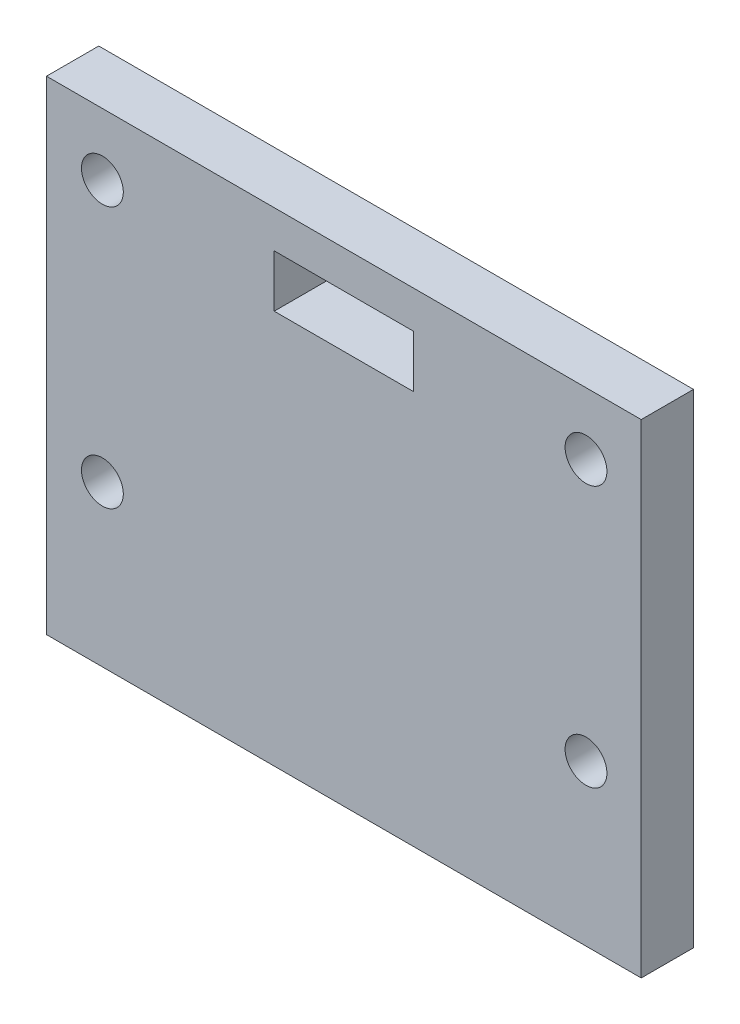
ISO-10303-21;
HEADER;
FILE_DESCRIPTION(('STEP AP214'),'2;1');
FILE_NAME('part.step','',(''),(''),'','','');
FILE_SCHEMA(('AUTOMOTIVE_DESIGN { 1 0 10303 214 1 1 1 1 }'));
ENDSEC;
DATA;
#1=APPLICATION_CONTEXT('core data for automotive mechanical design processes');
#2=APPLICATION_PROTOCOL_DEFINITION('international standard','automotive_design',2000,#1);
#3=PRODUCT_CONTEXT('',#1,'mechanical');
#4=PRODUCT('Part','Part','',(#3));
#5=PRODUCT_RELATED_PRODUCT_CATEGORY('part','',(#4));
#6=PRODUCT_DEFINITION_FORMATION('','',#4);
#7=PRODUCT_DEFINITION_CONTEXT('part definition',#1,'design');
#8=PRODUCT_DEFINITION('design','',#6,#7);
#9=PRODUCT_DEFINITION_SHAPE('','',#8);
#10=(LENGTH_UNIT() NAMED_UNIT(*) SI_UNIT(.MILLI.,.METRE.));
#11=(NAMED_UNIT(*) PLANE_ANGLE_UNIT() SI_UNIT($,.RADIAN.));
#12=(NAMED_UNIT(*) SI_UNIT($,.STERADIAN.) SOLID_ANGLE_UNIT());
#13=UNCERTAINTY_MEASURE_WITH_UNIT(LENGTH_MEASURE(1.E-05),#10,'distance_accuracy_value','');
#14=(GEOMETRIC_REPRESENTATION_CONTEXT(3) GLOBAL_UNCERTAINTY_ASSIGNED_CONTEXT((#13)) GLOBAL_UNIT_ASSIGNED_CONTEXT((#10,
#11,#12)) REPRESENTATION_CONTEXT('',''));
#15=CARTESIAN_POINT('',(0.,0.,0.));
#16=DIRECTION('',(0.,0.,1.));
#17=DIRECTION('',(1.,0.,0.));
#18=AXIS2_PLACEMENT_3D('',#15,#16,#17);
#19=CARTESIAN_POINT('',(0.,0.,4.));
#20=DIRECTION('',(0.,0.,-1.));
#21=DIRECTION('',(-1.,0.,0.));
#22=AXIS2_PLACEMENT_3D('',#19,#20,#21);
#23=PLANE('',#22);
#24=CARTESIAN_POINT('',(4.27584890969045,32.2525920824198,4.));
#25=DIRECTION('',(0.,0.,-1.));
#26=DIRECTION('',(-1.,0.,0.));
#27=AXIS2_PLACEMENT_3D('',#24,#25,#26);
#28=CIRCLE('',#27,1.6);
#29=CARTESIAN_POINT('',(2.67584890969045,32.2525920824198,4.));
#30=VERTEX_POINT('',#29);
#31=EDGE_CURVE('E132',#30,#30,#28,.T.);
#32=ORIENTED_EDGE('',*,*,#31,.T.);
#33=EDGE_LOOP('',(#32));
#34=FACE_BOUND('',#33,.T.);
#35=CARTESIAN_POINT('',(4.27584890969045,12.2525920824197,4.));
#36=DIRECTION('',(0.,0.,-1.));
#37=DIRECTION('',(-1.,0.,0.));
#38=AXIS2_PLACEMENT_3D('',#35,#36,#37);
#39=CIRCLE('',#38,1.6);
#40=CARTESIAN_POINT('',(2.67584890969045,12.2525920824197,4.));
#41=VERTEX_POINT('',#40);
#42=EDGE_CURVE('E176',#41,#41,#39,.T.);
#43=ORIENTED_EDGE('',*,*,#42,.T.);
#44=EDGE_LOOP('',(#43));
#45=FACE_BOUND('',#44,.T.);
#46=CARTESIAN_POINT('',(41.2758489096904,12.2525920824197,4.));
#47=DIRECTION('',(0.,0.,-1.));
#48=DIRECTION('',(-1.,0.,0.));
#49=AXIS2_PLACEMENT_3D('',#46,#47,#48);
#50=CIRCLE('',#49,1.6);
#51=CARTESIAN_POINT('',(39.6758489096904,12.2525920824197,4.));
#52=VERTEX_POINT('',#51);
#53=EDGE_CURVE('E173',#52,#52,#50,.T.);
#54=ORIENTED_EDGE('',*,*,#53,.T.);
#55=EDGE_LOOP('',(#54));
#56=FACE_BOUND('',#55,.T.);
#57=CARTESIAN_POINT('',(41.2758489096905,32.2525920824197,4.));
#58=DIRECTION('',(0.,0.,-1.));
#59=DIRECTION('',(-1.,0.,0.));
#60=AXIS2_PLACEMENT_3D('',#57,#58,#59);
#61=CIRCLE('',#60,1.60000000000001);
#62=CARTESIAN_POINT('',(39.6758489096904,32.2525920824197,4.));
#63=VERTEX_POINT('',#62);
#64=EDGE_CURVE('E170',#63,#63,#61,.T.);
#65=ORIENTED_EDGE('',*,*,#64,.T.);
#66=EDGE_LOOP('',(#65));
#67=FACE_BOUND('',#66,.T.);
#68=DIRECTION('',(0.,-1.,0.));
#69=VECTOR('',#68,1.);
#70=CARTESIAN_POINT('',(0.,0.,4.));
#71=LINE('',#70,#69);
#72=CARTESIAN_POINT('',(0.,37.,4.));
#73=VERTEX_POINT('',#72);
#74=CARTESIAN_POINT('',(0.,0.,4.));
#75=VERTEX_POINT('',#74);
#76=EDGE_CURVE('E142',#73,#75,#71,.T.);
#77=ORIENTED_EDGE('',*,*,#76,.T.);
#78=DIRECTION('',(1.,0.,0.));
#79=VECTOR('',#78,1.);
#80=CARTESIAN_POINT('',(0.,0.,4.));
#81=LINE('',#80,#79);
#82=CARTESIAN_POINT('',(45.5,0.,4.));
#83=VERTEX_POINT('',#82);
#84=EDGE_CURVE('E145',#75,#83,#81,.T.);
#85=ORIENTED_EDGE('',*,*,#84,.T.);
#86=DIRECTION('',(0.,1.,0.));
#87=VECTOR('',#86,1.);
#88=CARTESIAN_POINT('',(45.5,0.,4.));
#89=LINE('',#88,#87);
#90=CARTESIAN_POINT('',(45.5,37.,4.));
#91=VERTEX_POINT('',#90);
#92=EDGE_CURVE('E148',#83,#91,#89,.T.);
#93=ORIENTED_EDGE('',*,*,#92,.T.);
#94=DIRECTION('',(-1.,0.,0.));
#95=VECTOR('',#94,1.);
#96=CARTESIAN_POINT('',(0.,37.,4.));
#97=LINE('',#96,#95);
#98=EDGE_CURVE('E150',#91,#73,#97,.T.);
#99=ORIENTED_EDGE('',*,*,#98,.T.);
#100=EDGE_LOOP('',(#77,#85,#93,#99));
#101=FACE_BOUND('',#100,.T.);
#102=DIRECTION('',(0.,-1.,0.));
#103=VECTOR('',#102,1.);
#104=CARTESIAN_POINT('',(17.42,34.14,4.));
#105=LINE('',#104,#103);
#106=CARTESIAN_POINT('',(17.42,34.14,4.));
#107=VERTEX_POINT('',#106);
#108=CARTESIAN_POINT('',(17.42,30.14,4.));
#109=VERTEX_POINT('',#108);
#110=EDGE_CURVE('E104',#107,#109,#105,.T.);
#111=ORIENTED_EDGE('',*,*,#110,.F.);
#112=DIRECTION('',(-1.,0.,0.));
#113=VECTOR('',#112,1.);
#114=CARTESIAN_POINT('',(17.42,34.14,4.));
#115=LINE('',#114,#113);
#116=CARTESIAN_POINT('',(28.08,34.14,4.));
#117=VERTEX_POINT('',#116);
#118=EDGE_CURVE('E126',#117,#107,#115,.T.);
#119=ORIENTED_EDGE('',*,*,#118,.F.);
#120=DIRECTION('',(0.,1.,0.));
#121=VECTOR('',#120,1.);
#122=CARTESIAN_POINT('',(28.08,34.14,4.));
#123=LINE('',#122,#121);
#124=CARTESIAN_POINT('',(28.08,30.14,4.));
#125=VERTEX_POINT('',#124);
#126=EDGE_CURVE('E124',#125,#117,#123,.T.);
#127=ORIENTED_EDGE('',*,*,#126,.F.);
#128=DIRECTION('',(1.,0.,0.));
#129=VECTOR('',#128,1.);
#130=CARTESIAN_POINT('',(17.42,30.14,4.));
#131=LINE('',#130,#129);
#132=EDGE_CURVE('E112',#109,#125,#131,.T.);
#133=ORIENTED_EDGE('',*,*,#132,.F.);
#134=EDGE_LOOP('',(#111,#119,#127,#133));
#135=FACE_BOUND('',#134,.T.);
#136=ADVANCED_FACE('F37',(#34,#45,#56,#67,#101,#135),#23,.F.);
#137=CARTESIAN_POINT('',(0.,0.,0.));
#138=DIRECTION('',(0.,0.,-1.));
#139=DIRECTION('',(-1.,0.,0.));
#140=AXIS2_PLACEMENT_3D('',#137,#138,#139);
#141=PLANE('',#140);
#142=CARTESIAN_POINT('',(4.27584890969045,32.2525920824198,0.));
#143=DIRECTION('',(0.,0.,-1.));
#144=DIRECTION('',(-1.,0.,0.));
#145=AXIS2_PLACEMENT_3D('',#142,#143,#144);
#146=CIRCLE('',#145,1.6);
#147=CARTESIAN_POINT('',(2.67584890969045,32.2525920824198,0.));
#148=VERTEX_POINT('',#147);
#149=EDGE_CURVE('E41',#148,#148,#146,.T.);
#150=ORIENTED_EDGE('',*,*,#149,.F.);
#151=EDGE_LOOP('',(#150));
#152=FACE_BOUND('',#151,.T.);
#153=CARTESIAN_POINT('',(4.27584890969045,12.2525920824197,0.));
#154=DIRECTION('',(0.,0.,-1.));
#155=DIRECTION('',(-1.,0.,0.));
#156=AXIS2_PLACEMENT_3D('',#153,#154,#155);
#157=CIRCLE('',#156,1.6);
#158=CARTESIAN_POINT('',(2.67584890969045,12.2525920824197,0.));
#159=VERTEX_POINT('',#158);
#160=EDGE_CURVE('E174',#159,#159,#157,.T.);
#161=ORIENTED_EDGE('',*,*,#160,.F.);
#162=EDGE_LOOP('',(#161));
#163=FACE_BOUND('',#162,.T.);
#164=CARTESIAN_POINT('',(41.2758489096904,12.2525920824197,0.));
#165=DIRECTION('',(0.,0.,-1.));
#166=DIRECTION('',(-1.,0.,0.));
#167=AXIS2_PLACEMENT_3D('',#164,#165,#166);
#168=CIRCLE('',#167,1.6);
#169=CARTESIAN_POINT('',(39.6758489096904,12.2525920824197,0.));
#170=VERTEX_POINT('',#169);
#171=EDGE_CURVE('E171',#170,#170,#168,.T.);
#172=ORIENTED_EDGE('',*,*,#171,.F.);
#173=EDGE_LOOP('',(#172));
#174=FACE_BOUND('',#173,.T.);
#175=CARTESIAN_POINT('',(41.2758489096905,32.2525920824197,0.));
#176=DIRECTION('',(0.,0.,-1.));
#177=DIRECTION('',(-1.,0.,0.));
#178=AXIS2_PLACEMENT_3D('',#175,#176,#177);
#179=CIRCLE('',#178,1.60000000000001);
#180=CARTESIAN_POINT('',(39.6758489096904,32.2525920824197,0.));
#181=VERTEX_POINT('',#180);
#182=EDGE_CURVE('E167',#181,#181,#179,.T.);
#183=ORIENTED_EDGE('',*,*,#182,.F.);
#184=EDGE_LOOP('',(#183));
#185=FACE_BOUND('',#184,.T.);
#186=DIRECTION('',(0.,-1.,0.));
#187=VECTOR('',#186,1.);
#188=CARTESIAN_POINT('',(0.,0.,0.));
#189=LINE('',#188,#187);
#190=CARTESIAN_POINT('',(0.,37.,0.));
#191=VERTEX_POINT('',#190);
#192=CARTESIAN_POINT('',(0.,0.,0.));
#193=VERTEX_POINT('',#192);
#194=EDGE_CURVE('E120',#191,#193,#189,.T.);
#195=ORIENTED_EDGE('',*,*,#194,.F.);
#196=DIRECTION('',(-1.,0.,0.));
#197=VECTOR('',#196,1.);
#198=CARTESIAN_POINT('',(0.,37.,0.));
#199=LINE('',#198,#197);
#200=CARTESIAN_POINT('',(45.5,37.,0.));
#201=VERTEX_POINT('',#200);
#202=EDGE_CURVE('E146',#201,#191,#199,.T.);
#203=ORIENTED_EDGE('',*,*,#202,.F.);
#204=DIRECTION('',(0.,1.,0.));
#205=VECTOR('',#204,1.);
#206=CARTESIAN_POINT('',(45.5,0.,0.));
#207=LINE('',#206,#205);
#208=CARTESIAN_POINT('',(45.5,0.,0.));
#209=VERTEX_POINT('',#208);
#210=EDGE_CURVE('E157',#209,#201,#207,.T.);
#211=ORIENTED_EDGE('',*,*,#210,.F.);
#212=DIRECTION('',(1.,0.,0.));
#213=VECTOR('',#212,1.);
#214=CARTESIAN_POINT('',(0.,0.,0.));
#215=LINE('',#214,#213);
#216=EDGE_CURVE('E155',#193,#209,#215,.T.);
#217=ORIENTED_EDGE('',*,*,#216,.F.);
#218=EDGE_LOOP('',(#195,#203,#211,#217));
#219=FACE_BOUND('',#218,.T.);
#220=DIRECTION('',(-1.,0.,0.));
#221=VECTOR('',#220,1.);
#222=CARTESIAN_POINT('',(17.42,34.14,0.));
#223=LINE('',#222,#221);
#224=CARTESIAN_POINT('',(28.08,34.14,0.));
#225=VERTEX_POINT('',#224);
#226=CARTESIAN_POINT('',(17.42,34.14,0.));
#227=VERTEX_POINT('',#226);
#228=EDGE_CURVE('E113',#225,#227,#223,.T.);
#229=ORIENTED_EDGE('',*,*,#228,.T.);
#230=DIRECTION('',(0.,-1.,0.));
#231=VECTOR('',#230,1.);
#232=CARTESIAN_POINT('',(17.42,34.14,0.));
#233=LINE('',#232,#231);
#234=CARTESIAN_POINT('',(17.42,30.14,0.));
#235=VERTEX_POINT('',#234);
#236=EDGE_CURVE('E62',#227,#235,#233,.T.);
#237=ORIENTED_EDGE('',*,*,#236,.T.);
#238=DIRECTION('',(1.,0.,0.));
#239=VECTOR('',#238,1.);
#240=CARTESIAN_POINT('',(17.42,30.14,0.));
#241=LINE('',#240,#239);
#242=CARTESIAN_POINT('',(28.08,30.14,0.));
#243=VERTEX_POINT('',#242);
#244=EDGE_CURVE('E119',#235,#243,#241,.T.);
#245=ORIENTED_EDGE('',*,*,#244,.T.);
#246=DIRECTION('',(0.,1.,0.));
#247=VECTOR('',#246,1.);
#248=CARTESIAN_POINT('',(28.08,34.14,0.));
#249=LINE('',#248,#247);
#250=EDGE_CURVE('E134',#243,#225,#249,.T.);
#251=ORIENTED_EDGE('',*,*,#250,.T.);
#252=EDGE_LOOP('',(#229,#237,#245,#251));
#253=FACE_BOUND('',#252,.T.);
#254=ADVANCED_FACE('F195',(#152,#163,#174,#185,#219,#253),#141,.T.);
#255=CARTESIAN_POINT('',(0.,0.,4.));
#256=DIRECTION('',(1.,0.,0.));
#257=DIRECTION('',(0.,0.,-1.));
#258=AXIS2_PLACEMENT_3D('',#255,#256,#257);
#259=PLANE('',#258);
#260=ORIENTED_EDGE('',*,*,#194,.T.);
#261=DIRECTION('',(0.,0.,-1.));
#262=VECTOR('',#261,1.);
#263=CARTESIAN_POINT('',(0.,0.,4.));
#264=LINE('',#263,#262);
#265=EDGE_CURVE('E11',#75,#193,#264,.T.);
#266=ORIENTED_EDGE('',*,*,#265,.F.);
#267=ORIENTED_EDGE('',*,*,#76,.F.);
#268=DIRECTION('',(0.,0.,-1.));
#269=VECTOR('',#268,1.);
#270=CARTESIAN_POINT('',(0.,37.,4.));
#271=LINE('',#270,#269);
#272=EDGE_CURVE('E152',#73,#191,#271,.T.);
#273=ORIENTED_EDGE('',*,*,#272,.T.);
#274=EDGE_LOOP('',(#260,#266,#267,#273));
#275=FACE_BOUND('',#274,.T.);
#276=ADVANCED_FACE('F39',(#275),#259,.F.);
#277=CARTESIAN_POINT('',(0.,0.,4.));
#278=DIRECTION('',(0.,1.,0.));
#279=DIRECTION('',(0.,0.,1.));
#280=AXIS2_PLACEMENT_3D('',#277,#278,#279);
#281=PLANE('',#280);
#282=ORIENTED_EDGE('',*,*,#216,.T.);
#283=DIRECTION('',(0.,0.,-1.));
#284=VECTOR('',#283,1.);
#285=CARTESIAN_POINT('',(45.5,0.,4.));
#286=LINE('',#285,#284);
#287=EDGE_CURVE('E46',#83,#209,#286,.T.);
#288=ORIENTED_EDGE('',*,*,#287,.F.);
#289=ORIENTED_EDGE('',*,*,#84,.F.);
#290=ORIENTED_EDGE('',*,*,#265,.T.);
#291=EDGE_LOOP('',(#282,#288,#289,#290));
#292=FACE_BOUND('',#291,.T.);
#293=ADVANCED_FACE('F236',(#292),#281,.F.);
#294=CARTESIAN_POINT('',(45.5,0.,4.));
#295=DIRECTION('',(-1.,0.,0.));
#296=DIRECTION('',(0.,0.,1.));
#297=AXIS2_PLACEMENT_3D('',#294,#295,#296);
#298=PLANE('',#297);
#299=ORIENTED_EDGE('',*,*,#210,.T.);
#300=DIRECTION('',(0.,0.,-1.));
#301=VECTOR('',#300,1.);
#302=CARTESIAN_POINT('',(45.5,37.,4.));
#303=LINE('',#302,#301);
#304=EDGE_CURVE('E162',#91,#201,#303,.T.);
#305=ORIENTED_EDGE('',*,*,#304,.F.);
#306=ORIENTED_EDGE('',*,*,#92,.F.);
#307=ORIENTED_EDGE('',*,*,#287,.T.);
#308=EDGE_LOOP('',(#299,#305,#306,#307));
#309=FACE_BOUND('',#308,.T.);
#310=ADVANCED_FACE('F233',(#309),#298,.F.);
#311=CARTESIAN_POINT('',(0.,37.,4.));
#312=DIRECTION('',(0.,-1.,0.));
#313=DIRECTION('',(0.,0.,-1.));
#314=AXIS2_PLACEMENT_3D('',#311,#312,#313);
#315=PLANE('',#314);
#316=ORIENTED_EDGE('',*,*,#202,.T.);
#317=ORIENTED_EDGE('',*,*,#272,.F.);
#318=ORIENTED_EDGE('',*,*,#98,.F.);
#319=ORIENTED_EDGE('',*,*,#304,.T.);
#320=EDGE_LOOP('',(#316,#317,#318,#319));
#321=FACE_BOUND('',#320,.T.);
#322=ADVANCED_FACE('F230',(#321),#315,.F.);
#323=CARTESIAN_POINT('',(17.42,34.14,4.));
#324=DIRECTION('',(1.,0.,0.));
#325=DIRECTION('',(0.,1.,0.));
#326=AXIS2_PLACEMENT_3D('',#323,#324,#325);
#327=PLANE('',#326);
#328=ORIENTED_EDGE('',*,*,#236,.F.);
#329=DIRECTION('',(0.,0.,-1.));
#330=VECTOR('',#329,1.);
#331=CARTESIAN_POINT('',(17.42,34.14,4.));
#332=LINE('',#331,#330);
#333=EDGE_CURVE('E108',#107,#227,#332,.T.);
#334=ORIENTED_EDGE('',*,*,#333,.F.);
#335=ORIENTED_EDGE('',*,*,#110,.T.);
#336=DIRECTION('',(0.,0.,-1.));
#337=VECTOR('',#336,1.);
#338=CARTESIAN_POINT('',(17.42,30.14,4.));
#339=LINE('',#338,#337);
#340=EDGE_CURVE('E107',#109,#235,#339,.T.);
#341=ORIENTED_EDGE('',*,*,#340,.T.);
#342=EDGE_LOOP('',(#328,#334,#335,#341));
#343=FACE_BOUND('',#342,.T.);
#344=ADVANCED_FACE('F106',(#343),#327,.T.);
#345=CARTESIAN_POINT('',(17.42,30.14,4.));
#346=DIRECTION('',(0.,1.,0.));
#347=DIRECTION('',(0.,0.,1.));
#348=AXIS2_PLACEMENT_3D('',#345,#346,#347);
#349=PLANE('',#348);
#350=ORIENTED_EDGE('',*,*,#244,.F.);
#351=ORIENTED_EDGE('',*,*,#340,.F.);
#352=ORIENTED_EDGE('',*,*,#132,.T.);
#353=DIRECTION('',(0.,0.,-1.));
#354=VECTOR('',#353,1.);
#355=CARTESIAN_POINT('',(28.08,30.14,4.));
#356=LINE('',#355,#354);
#357=EDGE_CURVE('E121',#125,#243,#356,.T.);
#358=ORIENTED_EDGE('',*,*,#357,.T.);
#359=EDGE_LOOP('',(#350,#351,#352,#358));
#360=FACE_BOUND('',#359,.T.);
#361=ADVANCED_FACE('F116',(#360),#349,.T.);
#362=CARTESIAN_POINT('',(28.08,34.14,4.));
#363=DIRECTION('',(-1.,0.,0.));
#364=DIRECTION('',(0.,0.,1.));
#365=AXIS2_PLACEMENT_3D('',#362,#363,#364);
#366=PLANE('',#365);
#367=ORIENTED_EDGE('',*,*,#250,.F.);
#368=ORIENTED_EDGE('',*,*,#357,.F.);
#369=ORIENTED_EDGE('',*,*,#126,.T.);
#370=DIRECTION('',(0.,0.,-1.));
#371=VECTOR('',#370,1.);
#372=CARTESIAN_POINT('',(28.08,34.14,4.));
#373=LINE('',#372,#371);
#374=EDGE_CURVE('E54',#117,#225,#373,.T.);
#375=ORIENTED_EDGE('',*,*,#374,.T.);
#376=EDGE_LOOP('',(#367,#368,#369,#375));
#377=FACE_BOUND('',#376,.T.);
#378=ADVANCED_FACE('F211',(#377),#366,.T.);
#379=CARTESIAN_POINT('',(17.42,34.14,4.));
#380=DIRECTION('',(0.,-1.,0.));
#381=DIRECTION('',(1.,0.,0.));
#382=AXIS2_PLACEMENT_3D('',#379,#380,#381);
#383=PLANE('',#382);
#384=ORIENTED_EDGE('',*,*,#228,.F.);
#385=ORIENTED_EDGE('',*,*,#374,.F.);
#386=ORIENTED_EDGE('',*,*,#118,.T.);
#387=ORIENTED_EDGE('',*,*,#333,.T.);
#388=EDGE_LOOP('',(#384,#385,#386,#387));
#389=FACE_BOUND('',#388,.T.);
#390=ADVANCED_FACE('F208',(#389),#383,.T.);
#391=CARTESIAN_POINT('',(41.2758489096905,32.2525920824197,-1.2E-05));
#392=DIRECTION('',(0.,0.,1.));
#393=DIRECTION('',(1.,0.,0.));
#394=AXIS2_PLACEMENT_3D('',#391,#392,#393);
#395=CYLINDRICAL_SURFACE('',#394,1.60000000000001);
#396=ORIENTED_EDGE('',*,*,#182,.T.);
#397=EDGE_LOOP('',(#396));
#398=FACE_BOUND('',#397,.T.);
#399=ORIENTED_EDGE('',*,*,#64,.F.);
#400=EDGE_LOOP('',(#399));
#401=FACE_BOUND('',#400,.T.);
#402=ADVANCED_FACE('F210',(#398,#401),#395,.F.);
#403=CARTESIAN_POINT('',(41.2758489096904,12.2525920824197,-1.2E-05));
#404=DIRECTION('',(0.,0.,1.));
#405=DIRECTION('',(1.,0.,0.));
#406=AXIS2_PLACEMENT_3D('',#403,#404,#405);
#407=CYLINDRICAL_SURFACE('',#406,1.6);
#408=ORIENTED_EDGE('',*,*,#171,.T.);
#409=EDGE_LOOP('',(#408));
#410=FACE_BOUND('',#409,.T.);
#411=ORIENTED_EDGE('',*,*,#53,.F.);
#412=EDGE_LOOP('',(#411));
#413=FACE_BOUND('',#412,.T.);
#414=ADVANCED_FACE('F217',(#410,#413),#407,.F.);
#415=CARTESIAN_POINT('',(4.27584890969045,12.2525920824197,-1.2E-05));
#416=DIRECTION('',(0.,0.,1.));
#417=DIRECTION('',(1.,0.,0.));
#418=AXIS2_PLACEMENT_3D('',#415,#416,#417);
#419=CYLINDRICAL_SURFACE('',#418,1.6);
#420=ORIENTED_EDGE('',*,*,#160,.T.);
#421=EDGE_LOOP('',(#420));
#422=FACE_BOUND('',#421,.T.);
#423=ORIENTED_EDGE('',*,*,#42,.F.);
#424=EDGE_LOOP('',(#423));
#425=FACE_BOUND('',#424,.T.);
#426=ADVANCED_FACE('F277',(#422,#425),#419,.F.);
#427=CARTESIAN_POINT('',(4.27584890969045,32.2525920824198,-1.2E-05));
#428=DIRECTION('',(0.,0.,1.));
#429=DIRECTION('',(1.,0.,0.));
#430=AXIS2_PLACEMENT_3D('',#427,#428,#429);
#431=CYLINDRICAL_SURFACE('',#430,1.6);
#432=ORIENTED_EDGE('',*,*,#149,.T.);
#433=EDGE_LOOP('',(#432));
#434=FACE_BOUND('',#433,.T.);
#435=ORIENTED_EDGE('',*,*,#31,.F.);
#436=EDGE_LOOP('',(#435));
#437=FACE_BOUND('',#436,.T.);
#438=ADVANCED_FACE('F192',(#434,#437),#431,.F.);
#439=CLOSED_SHELL('',(#136,#254,#276,#293,#310,#322,#344,#361,#378,#390,#402,#414,#426,#438));
#440=MANIFOLD_SOLID_BREP('B2',#439);
#441=ADVANCED_BREP_SHAPE_REPRESENTATION('',(#18,#440),#14);
#442=SHAPE_DEFINITION_REPRESENTATION(#9,#441);
ENDSEC;
END-ISO-10303-21;
